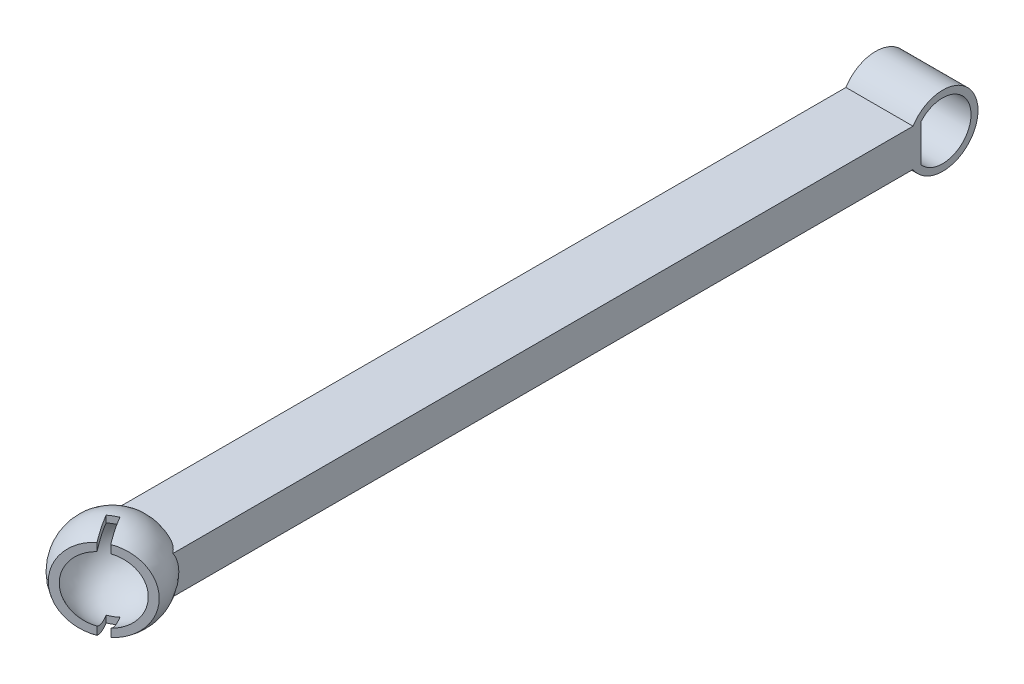
ISO-10303-21;
HEADER;
FILE_DESCRIPTION(('STEP AP214'),'2;1');
FILE_NAME('part.step','',(''),(''),'','','');
FILE_SCHEMA(('AUTOMOTIVE_DESIGN { 1 0 10303 214 1 1 1 1 }'));
ENDSEC;
DATA;
#1=APPLICATION_CONTEXT('core data for automotive mechanical design processes');
#2=APPLICATION_PROTOCOL_DEFINITION('international standard','automotive_design',2000,#1);
#3=PRODUCT_CONTEXT('',#1,'mechanical');
#4=PRODUCT('Part','Part','',(#3));
#5=PRODUCT_RELATED_PRODUCT_CATEGORY('part','',(#4));
#6=PRODUCT_DEFINITION_FORMATION('','',#4);
#7=PRODUCT_DEFINITION_CONTEXT('part definition',#1,'design');
#8=PRODUCT_DEFINITION('design','',#6,#7);
#9=PRODUCT_DEFINITION_SHAPE('','',#8);
#10=(LENGTH_UNIT() NAMED_UNIT(*) SI_UNIT(.MILLI.,.METRE.));
#11=(NAMED_UNIT(*) PLANE_ANGLE_UNIT() SI_UNIT($,.RADIAN.));
#12=(NAMED_UNIT(*) SI_UNIT($,.STERADIAN.) SOLID_ANGLE_UNIT());
#13=UNCERTAINTY_MEASURE_WITH_UNIT(LENGTH_MEASURE(1.E-05),#10,'distance_accuracy_value','');
#14=(GEOMETRIC_REPRESENTATION_CONTEXT(3) GLOBAL_UNCERTAINTY_ASSIGNED_CONTEXT((#13)) GLOBAL_UNIT_ASSIGNED_CONTEXT((#10,
#11,#12)) REPRESENTATION_CONTEXT('',''));
#15=CARTESIAN_POINT('',(0.,0.,0.));
#16=DIRECTION('',(0.,0.,1.));
#17=DIRECTION('',(1.,0.,0.));
#18=AXIS2_PLACEMENT_3D('',#15,#16,#17);
#19=CARTESIAN_POINT('',(-24.8547884615764,0.,113.899321100074));
#20=DIRECTION('',(0.499999999999998,0.,0.86602540378444));
#21=DIRECTION('',(0.86602540378444,0.,-0.499999999999998));
#22=AXIS2_PLACEMENT_3D('',#19,#20,#21);
#23=PLANE('',#22);
#24=DIRECTION('',(0.,-1.,0.));
#25=VECTOR('',#24,1.);
#26=CARTESIAN_POINT('',(-5.51062688470104,-23.9262644459295,102.730964206417));
#27=LINE('',#26,#25);
#28=CARTESIAN_POINT('',(-5.51062688470104,-13.5200077586692,102.730964206417));
#29=VERTEX_POINT('',#28);
#30=CARTESIAN_POINT('',(-5.51062688470103,-14.4817744480449,102.730964206417));
#31=VERTEX_POINT('',#30);
#32=EDGE_CURVE('E244',#29,#31,#27,.T.);
#33=ORIENTED_EDGE('',*,*,#32,.F.);
#34=CARTESIAN_POINT('',(-4.9996305065862,-18.3262644459295,102.435940309958));
#35=DIRECTION('',(0.499999999999998,0.,0.86602540378444));
#36=DIRECTION('',(0.86602540378444,0.,-0.499999999999998));
#37=AXIS2_PLACEMENT_3D('',#34,#35,#36);
#38=CIRCLE('',#37,4.84234031659929);
#39=CARTESIAN_POINT('',(-5.51062688470104,-23.1325211331898,102.730964206417));
#40=VERTEX_POINT('',#39);
#41=EDGE_CURVE('E165',#40,#29,#38,.F.);
#42=ORIENTED_EDGE('',*,*,#41,.F.);
#43=CARTESIAN_POINT('',(-5.51062688470103,-22.170754443814,102.730964206417));
#44=VERTEX_POINT('',#43);
#45=EDGE_CURVE('E157',#44,#40,#27,.T.);
#46=ORIENTED_EDGE('',*,*,#45,.F.);
#47=CARTESIAN_POINT('',(-4.9996305065862,-18.3262644459295,102.435940309958));
#48=DIRECTION('',(0.499999999999998,0.,0.86602540378444));
#49=DIRECTION('',(0.86602540378444,0.,-0.499999999999998));
#50=AXIS2_PLACEMENT_3D('',#47,#48,#49);
#51=CIRCLE('',#50,3.88950636222168);
#52=EDGE_CURVE('E166',#44,#31,#51,.F.);
#53=ORIENTED_EDGE('',*,*,#52,.T.);
#54=EDGE_LOOP('',(#33,#42,#46,#53));
#55=FACE_BOUND('',#54,.T.);
#56=ADVANCED_FACE('F37',(#55),#23,.T.);
#57=CARTESIAN_POINT('',(-6.40602130027024,-18.3262644459295,100.));
#58=DIRECTION('',(0.,1.,0.));
#59=DIRECTION('',(1.,0.,0.));
#60=AXIS2_PLACEMENT_3D('',#57,#58,#59);
#61=SPHERICAL_SURFACE('',#60,5.6);
#62=CARTESIAN_POINT('',(-6.9170176783851,-18.3262644459295,100.29502389646));
#63=DIRECTION('',(-0.86602540378444,0.,0.499999999999998));
#64=DIRECTION('',(0.499999999999998,0.,0.86602540378444));
#65=AXIS2_PLACEMENT_3D('',#62,#63,#64);
#66=CIRCLE('',#65,5.56882784812669);
#67=CARTESIAN_POINT('',(-7.01062688470102,-23.8919443566001,100.132887995064));
#68=VERTEX_POINT('',#67);
#69=EDGE_CURVE('E223',#40,#68,#66,.F.);
#70=ORIENTED_EDGE('',*,*,#69,.F.);
#71=ORIENTED_EDGE('',*,*,#41,.T.);
#72=CARTESIAN_POINT('',(-7.01062688470102,-12.7605845352588,100.132887995064));
#73=VERTEX_POINT('',#72);
#74=EDGE_CURVE('E146',#73,#29,#66,.F.);
#75=ORIENTED_EDGE('',*,*,#74,.F.);
#76=CARTESIAN_POINT('',(-6.49963050658617,-18.3262644459295,99.8378640986046));
#77=DIRECTION('',(0.499999999999994,0.,0.866025403784442));
#78=DIRECTION('',(0.866025403784442,0.,-0.499999999999994));
#79=AXIS2_PLACEMENT_3D('',#76,#77,#78);
#80=CIRCLE('',#79,5.59686959522657);
#81=CARTESIAN_POINT('',(-5.9713964001597,-12.7627307153722,99.5328879950642));
#82=VERTEX_POINT('',#81);
#83=EDGE_CURVE('E248',#73,#82,#80,.F.);
#84=ORIENTED_EDGE('',*,*,#83,.T.);
#85=CARTESIAN_POINT('',(-5.87778719384377,-18.3262644459295,99.6950238964595));
#86=DIRECTION('',(0.86602540378444,0.,-0.499999999999998));
#87=DIRECTION('',(-0.499999999999998,0.,-0.86602540378444));
#88=AXIS2_PLACEMENT_3D('',#85,#86,#87);
#89=CIRCLE('',#88,5.56668288166994);
#90=CARTESIAN_POINT('',(-4.47139640015971,-13.5224932141949,102.130964206417));
#91=VERTEX_POINT('',#90);
#92=EDGE_CURVE('E147',#91,#82,#89,.F.);
#93=ORIENTED_EDGE('',*,*,#92,.F.);
#94=CARTESIAN_POINT('',(-4.47139640015971,-23.130035677664,102.130964206417));
#95=VERTEX_POINT('',#94);
#96=EDGE_CURVE('E154',#91,#95,#38,.F.);
#97=ORIENTED_EDGE('',*,*,#96,.T.);
#98=CARTESIAN_POINT('',(-5.9713964001597,-23.8897981764867,99.5328879950642));
#99=VERTEX_POINT('',#98);
#100=EDGE_CURVE('E138',#99,#95,#89,.F.);
#101=ORIENTED_EDGE('',*,*,#100,.F.);
#102=EDGE_CURVE('E249',#99,#68,#80,.F.);
#103=ORIENTED_EDGE('',*,*,#102,.T.);
#104=EDGE_LOOP('',(#70,#71,#75,#84,#93,#97,#101,#103));
#105=FACE_BOUND('',#104,.T.);
#106=CARTESIAN_POINT('',(-10.4060213002702,-18.3262644459295,100.));
#107=DIRECTION('',(1.,0.,0.));
#108=DIRECTION('',(0.,1.,0.));
#109=AXIS2_PLACEMENT_3D('',#106,#107,#108);
#110=CIRCLE('',#109,3.91918358845309);
#111=CARTESIAN_POINT('',(-10.4060213002702,-20.5629394281161,96.7817263907399));
#112=VERTEX_POINT('',#111);
#113=CARTESIAN_POINT('',(-10.4060213002702,-16.0895894637428,96.7817263907399));
#114=VERTEX_POINT('',#113);
#115=EDGE_CURVE('E176',#112,#114,#110,.T.);
#116=ORIENTED_EDGE('',*,*,#115,.F.);
#117=CARTESIAN_POINT('',(-6.40602130027024,-20.5629394281161,100.));
#118=DIRECTION('',(0.,-1.,0.));
#119=DIRECTION('',(1.,0.,0.));
#120=AXIS2_PLACEMENT_3D('',#117,#118,#119);
#121=CIRCLE('',#120,5.13393465327134);
#122=CARTESIAN_POINT('',(-2.40602130027024,-20.5629394281161,96.7817263907399));
#123=VERTEX_POINT('',#122);
#124=EDGE_CURVE('E179',#112,#123,#121,.T.);
#125=ORIENTED_EDGE('',*,*,#124,.T.);
#126=CARTESIAN_POINT('',(-2.40602130027024,-18.3262644459295,100.));
#127=DIRECTION('',(-1.,0.,0.));
#128=DIRECTION('',(0.,-1.,0.));
#129=AXIS2_PLACEMENT_3D('',#126,#127,#128);
#130=CIRCLE('',#129,3.91918358845308);
#131=CARTESIAN_POINT('',(-2.40602130027024,-16.0895894637428,96.7817263907399));
#132=VERTEX_POINT('',#131);
#133=EDGE_CURVE('E169',#132,#123,#130,.T.);
#134=ORIENTED_EDGE('',*,*,#133,.F.);
#135=CARTESIAN_POINT('',(-6.40602130027024,-16.0895894637428,100.));
#136=DIRECTION('',(0.,-1.,0.));
#137=DIRECTION('',(1.,0.,0.));
#138=AXIS2_PLACEMENT_3D('',#135,#136,#137);
#139=CIRCLE('',#138,5.13393465327134);
#140=EDGE_CURVE('E219',#114,#132,#139,.T.);
#141=ORIENTED_EDGE('',*,*,#140,.F.);
#142=EDGE_LOOP('',(#116,#125,#134,#141));
#143=FACE_BOUND('',#142,.T.);
#144=ADVANCED_FACE('F162',(#105,#143),#61,.T.);
#145=CARTESIAN_POINT('',(-10.4060213002702,-12.3317262756318,100.));
#146=DIRECTION('',(1.,0.,0.));
#147=DIRECTION('',(0.,1.,0.));
#148=AXIS2_PLACEMENT_3D('',#145,#146,#147);
#149=PLANE('',#148);
#150=DIRECTION('',(0.,-1.,0.));
#151=VECTOR('',#150,1.);
#152=CARTESIAN_POINT('',(-10.4060213002702,0.,7.55593867625419));
#153=LINE('',#152,#151);
#154=CARTESIAN_POINT('',(-10.4060213002702,-16.0895894637428,7.55593867625418));
#155=VERTEX_POINT('',#154);
#156=CARTESIAN_POINT('',(-10.4060213002702,-20.5738630875209,7.55593867625418));
#157=VERTEX_POINT('',#156);
#158=EDGE_CURVE('E200',#155,#157,#153,.T.);
#159=ORIENTED_EDGE('',*,*,#158,.T.);
#160=CARTESIAN_POINT('',(-10.4060213002702,-18.3317262756318,5.));
#161=DIRECTION('',(-1.,0.,0.));
#162=DIRECTION('',(0.,-1.,0.));
#163=AXIS2_PLACEMENT_3D('',#160,#161,#162);
#164=CIRCLE('',#163,3.4);
#165=EDGE_CURVE('E203',#155,#157,#164,.T.);
#166=ORIENTED_EDGE('',*,*,#165,.F.);
#167=EDGE_LOOP('',(#159,#166));
#168=FACE_BOUND('',#167,.T.);
#169=DIRECTION('',(0.,0.,1.));
#170=VECTOR('',#169,1.);
#171=CARTESIAN_POINT('',(-10.4060213002702,-20.5629394281161,0.));
#172=LINE('',#171,#170);
#173=CARTESIAN_POINT('',(-10.4060213002702,-20.5629394281161,8.52899757981099));
#174=VERTEX_POINT('',#173);
#175=EDGE_CURVE('E187',#174,#112,#172,.T.);
#176=ORIENTED_EDGE('',*,*,#175,.T.);
#177=ORIENTED_EDGE('',*,*,#115,.T.);
#178=DIRECTION('',(0.,0.,1.));
#179=VECTOR('',#178,1.);
#180=CARTESIAN_POINT('',(-10.4060213002702,-16.0895894637428,0.));
#181=LINE('',#180,#179);
#182=CARTESIAN_POINT('',(-10.4060213002702,-16.0895894637428,8.52212460336182));
#183=VERTEX_POINT('',#182);
#184=EDGE_CURVE('E184',#183,#114,#181,.T.);
#185=ORIENTED_EDGE('',*,*,#184,.F.);
#186=CARTESIAN_POINT('',(-10.4060213002702,-18.3317262756319,4.97067102535014));
#187=DIRECTION('',(-1.,0.,0.));
#188=DIRECTION('',(0.,-1.,0.));
#189=AXIS2_PLACEMENT_3D('',#186,#187,#188);
#190=CIRCLE('',#189,4.2);
#191=EDGE_CURVE('E181',#183,#174,#190,.T.);
#192=ORIENTED_EDGE('',*,*,#191,.T.);
#193=EDGE_LOOP('',(#176,#177,#185,#192));
#194=FACE_BOUND('',#193,.T.);
#195=ADVANCED_FACE('F39',(#168,#194),#149,.F.);
#196=CARTESIAN_POINT('',(-2.40602130027024,-12.3317262756318,100.));
#197=DIRECTION('',(-1.,0.,0.));
#198=DIRECTION('',(0.,-1.,0.));
#199=AXIS2_PLACEMENT_3D('',#196,#197,#198);
#200=PLANE('',#199);
#201=DIRECTION('',(0.,-1.,0.));
#202=VECTOR('',#201,1.);
#203=CARTESIAN_POINT('',(-2.40602130027024,-12.3317262756318,7.55593867625419));
#204=LINE('',#203,#202);
#205=CARTESIAN_POINT('',(-2.40602130027024,-16.0895894637428,7.55593867625418));
#206=VERTEX_POINT('',#205);
#207=CARTESIAN_POINT('',(-2.40602130027024,-20.5738630875209,7.55593867625418));
#208=VERTEX_POINT('',#207);
#209=EDGE_CURVE('E214',#206,#208,#204,.T.);
#210=ORIENTED_EDGE('',*,*,#209,.F.);
#211=CARTESIAN_POINT('',(-2.40602130027024,-18.3317262756318,5.));
#212=DIRECTION('',(-1.,0.,0.));
#213=DIRECTION('',(0.,-1.,0.));
#214=AXIS2_PLACEMENT_3D('',#211,#212,#213);
#215=CIRCLE('',#214,3.4);
#216=EDGE_CURVE('E209',#206,#208,#215,.T.);
#217=ORIENTED_EDGE('',*,*,#216,.T.);
#218=EDGE_LOOP('',(#210,#217));
#219=FACE_BOUND('',#218,.T.);
#220=DIRECTION('',(0.,0.,1.));
#221=VECTOR('',#220,1.);
#222=CARTESIAN_POINT('',(-2.40602130027024,-16.0895894637428,100.));
#223=LINE('',#222,#221);
#224=CARTESIAN_POINT('',(-2.40602130027025,-16.0895894637428,8.52212460336182));
#225=VERTEX_POINT('',#224);
#226=EDGE_CURVE('E193',#225,#132,#223,.T.);
#227=ORIENTED_EDGE('',*,*,#226,.T.);
#228=ORIENTED_EDGE('',*,*,#133,.T.);
#229=DIRECTION('',(0.,0.,1.));
#230=VECTOR('',#229,1.);
#231=CARTESIAN_POINT('',(-2.40602130027024,-20.5629394281161,100.));
#232=LINE('',#231,#230);
#233=CARTESIAN_POINT('',(-2.40602130027025,-20.5629394281161,8.52899757981099));
#234=VERTEX_POINT('',#233);
#235=EDGE_CURVE('E197',#234,#123,#232,.T.);
#236=ORIENTED_EDGE('',*,*,#235,.F.);
#237=CARTESIAN_POINT('',(-2.40602130027025,-18.3317262756319,4.97067102535014));
#238=DIRECTION('',(-1.,0.,0.));
#239=DIRECTION('',(0.,-1.,0.));
#240=AXIS2_PLACEMENT_3D('',#237,#238,#239);
#241=CIRCLE('',#240,4.2);
#242=EDGE_CURVE('E217',#225,#234,#241,.T.);
#243=ORIENTED_EDGE('',*,*,#242,.F.);
#244=EDGE_LOOP('',(#227,#228,#236,#243));
#245=FACE_BOUND('',#244,.T.);
#246=ADVANCED_FACE('F300',(#219,#245),#200,.F.);
#247=CARTESIAN_POINT('',(-0.406021300270244,0.,7.55593867625419));
#248=DIRECTION('',(0.,0.,-1.));
#249=DIRECTION('',(0.,1.,0.));
#250=AXIS2_PLACEMENT_3D('',#247,#248,#249);
#251=PLANE('',#250);
#252=ORIENTED_EDGE('',*,*,#209,.T.);
#253=DIRECTION('',(-1.,0.,0.));
#254=VECTOR('',#253,1.);
#255=CARTESIAN_POINT('',(-0.40602130027024,-20.5738630875209,7.55593867625418));
#256=LINE('',#255,#254);
#257=EDGE_CURVE('E207',#208,#157,#256,.T.);
#258=ORIENTED_EDGE('',*,*,#257,.T.);
#259=ORIENTED_EDGE('',*,*,#158,.F.);
#260=DIRECTION('',(-1.,0.,0.));
#261=VECTOR('',#260,1.);
#262=CARTESIAN_POINT('',(-0.406021300270242,-16.0895894637428,7.55593867625418));
#263=LINE('',#262,#261);
#264=EDGE_CURVE('E206',#206,#155,#263,.T.);
#265=ORIENTED_EDGE('',*,*,#264,.F.);
#266=EDGE_LOOP('',(#252,#258,#259,#265));
#267=FACE_BOUND('',#266,.T.);
#268=ADVANCED_FACE('F297',(#267),#251,.T.);
#269=CARTESIAN_POINT('',(-0.40602130027024,-18.3317262756318,5.));
#270=DIRECTION('',(-1.,0.,0.));
#271=DIRECTION('',(0.,-1.,0.));
#272=AXIS2_PLACEMENT_3D('',#269,#270,#271);
#273=CYLINDRICAL_SURFACE('',#272,3.4);
#274=ORIENTED_EDGE('',*,*,#264,.T.);
#275=ORIENTED_EDGE('',*,*,#165,.T.);
#276=ORIENTED_EDGE('',*,*,#257,.F.);
#277=ORIENTED_EDGE('',*,*,#216,.F.);
#278=EDGE_LOOP('',(#274,#275,#276,#277));
#279=FACE_BOUND('',#278,.T.);
#280=ADVANCED_FACE('F293',(#279),#273,.F.);
#281=CARTESIAN_POINT('',(89.5939786997298,-18.3317262756318,4.97067102535014));
#282=DIRECTION('',(-1.,0.,0.));
#283=DIRECTION('',(0.,-1.,0.));
#284=AXIS2_PLACEMENT_3D('',#281,#282,#283);
#285=CYLINDRICAL_SURFACE('',#284,4.2);
#286=ORIENTED_EDGE('',*,*,#242,.T.);
#287=DIRECTION('',(-1.,0.,0.));
#288=VECTOR('',#287,1.);
#289=CARTESIAN_POINT('',(89.5939786997298,-20.5629394281161,8.52899757981099));
#290=LINE('',#289,#288);
#291=EDGE_CURVE('E191',#234,#174,#290,.T.);
#292=ORIENTED_EDGE('',*,*,#291,.T.);
#293=ORIENTED_EDGE('',*,*,#191,.F.);
#294=DIRECTION('',(-1.,0.,0.));
#295=VECTOR('',#294,1.);
#296=CARTESIAN_POINT('',(89.5939786997298,-16.0895894637428,8.52212460336182));
#297=LINE('',#296,#295);
#298=EDGE_CURVE('E190',#225,#183,#297,.T.);
#299=ORIENTED_EDGE('',*,*,#298,.F.);
#300=EDGE_LOOP('',(#286,#292,#293,#299));
#301=FACE_BOUND('',#300,.T.);
#302=ADVANCED_FACE('F287',(#301),#285,.T.);
#303=CARTESIAN_POINT('',(89.5939786997298,-20.5629394281161,0.));
#304=DIRECTION('',(0.,-1.,0.));
#305=DIRECTION('',(1.,0.,0.));
#306=AXIS2_PLACEMENT_3D('',#303,#304,#305);
#307=PLANE('',#306);
#308=ORIENTED_EDGE('',*,*,#124,.F.);
#309=ORIENTED_EDGE('',*,*,#175,.F.);
#310=ORIENTED_EDGE('',*,*,#291,.F.);
#311=ORIENTED_EDGE('',*,*,#235,.T.);
#312=EDGE_LOOP('',(#308,#309,#310,#311));
#313=FACE_BOUND('',#312,.T.);
#314=ADVANCED_FACE('F281',(#313),#307,.T.);
#315=CARTESIAN_POINT('',(89.5939786997298,-16.0895894637428,0.));
#316=DIRECTION('',(0.,-1.,0.));
#317=DIRECTION('',(1.,0.,0.));
#318=AXIS2_PLACEMENT_3D('',#315,#316,#317);
#319=PLANE('',#318);
#320=ORIENTED_EDGE('',*,*,#184,.T.);
#321=ORIENTED_EDGE('',*,*,#140,.T.);
#322=ORIENTED_EDGE('',*,*,#226,.F.);
#323=ORIENTED_EDGE('',*,*,#298,.T.);
#324=EDGE_LOOP('',(#320,#321,#322,#323));
#325=FACE_BOUND('',#324,.T.);
#326=ADVANCED_FACE('F276',(#325),#319,.F.);
#327=DIRECTION('',(0.,1.,0.));
#328=VECTOR('',#327,1.);
#329=CARTESIAN_POINT('',(-4.47139640015971,-23.9262644459295,102.130964206417));
#330=LINE('',#329,#328);
#331=CARTESIAN_POINT('',(-4.47139640015971,-22.1676467553123,102.130964206417));
#332=VERTEX_POINT('',#331);
#333=EDGE_CURVE('E141',#95,#332,#330,.T.);
#334=ORIENTED_EDGE('',*,*,#333,.F.);
#335=ORIENTED_EDGE('',*,*,#96,.F.);
#336=CARTESIAN_POINT('',(-4.47139640015971,-14.4848821365466,102.130964206417));
#337=VERTEX_POINT('',#336);
#338=EDGE_CURVE('E158',#337,#91,#330,.T.);
#339=ORIENTED_EDGE('',*,*,#338,.F.);
#340=EDGE_CURVE('E156',#337,#332,#51,.F.);
#341=ORIENTED_EDGE('',*,*,#340,.T.);
#342=EDGE_LOOP('',(#334,#335,#339,#341));
#343=FACE_BOUND('',#342,.T.);
#344=ADVANCED_FACE('F152',(#343),#23,.T.);
#345=CARTESIAN_POINT('',(-6.40602130027024,-18.3262644459295,100.));
#346=DIRECTION('',(0.,1.,0.));
#347=DIRECTION('',(1.,0.,0.));
#348=AXIS2_PLACEMENT_3D('',#345,#346,#347);
#349=SPHERICAL_SURFACE('',#348,4.8);
#350=ORIENTED_EDGE('',*,*,#52,.F.);
#351=CARTESIAN_POINT('',(-6.9170176783851,-18.3262644459295,100.29502389646));
#352=DIRECTION('',(-0.86602540378444,0.,0.499999999999998));
#353=DIRECTION('',(0.499999999999998,0.,0.86602540378444));
#354=AXIS2_PLACEMENT_3D('',#351,#352,#353);
#355=CIRCLE('',#354,4.76359565896092);
#356=CARTESIAN_POINT('',(-7.01062688470102,-23.0861796624058,100.132887995064));
#357=VERTEX_POINT('',#356);
#358=EDGE_CURVE('E11',#44,#357,#355,.F.);
#359=ORIENTED_EDGE('',*,*,#358,.T.);
#360=CARTESIAN_POINT('',(-6.49963050658617,-18.3262644459295,99.8378640986046));
#361=DIRECTION('',(0.499999999999994,0.,0.866025403784442));
#362=DIRECTION('',(0.866025403784442,0.,-0.499999999999994));
#363=AXIS2_PLACEMENT_3D('',#360,#361,#362);
#364=CIRCLE('',#363,4.796347492204);
#365=CARTESIAN_POINT('',(-5.9713964001597,-23.083669996337,99.5328879950642));
#366=VERTEX_POINT('',#365);
#367=EDGE_CURVE('E225',#366,#357,#364,.F.);
#368=ORIENTED_EDGE('',*,*,#367,.F.);
#369=CARTESIAN_POINT('',(-5.87778719384377,-18.3262644459295,99.6950238964595));
#370=DIRECTION('',(0.86602540378444,0.,-0.499999999999998));
#371=DIRECTION('',(-0.499999999999998,0.,-0.86602540378444));
#372=AXIS2_PLACEMENT_3D('',#369,#370,#371);
#373=CIRCLE('',#372,4.76108793292847);
#374=EDGE_CURVE('E46',#366,#332,#373,.F.);
#375=ORIENTED_EDGE('',*,*,#374,.T.);
#376=ORIENTED_EDGE('',*,*,#340,.F.);
#377=CARTESIAN_POINT('',(-5.9713964001597,-13.5688588955219,99.5328879950642));
#378=VERTEX_POINT('',#377);
#379=EDGE_CURVE('E224',#337,#378,#373,.F.);
#380=ORIENTED_EDGE('',*,*,#379,.T.);
#381=CARTESIAN_POINT('',(-7.01062688470102,-13.5663492294531,100.132887995064));
#382=VERTEX_POINT('',#381);
#383=EDGE_CURVE('E221',#382,#378,#364,.F.);
#384=ORIENTED_EDGE('',*,*,#383,.F.);
#385=EDGE_CURVE('E41',#382,#31,#355,.F.);
#386=ORIENTED_EDGE('',*,*,#385,.T.);
#387=EDGE_LOOP('',(#350,#359,#368,#375,#376,#380,#384,#386));
#388=FACE_BOUND('',#387,.T.);
#389=ADVANCED_FACE('F240',(#388),#349,.F.);
#390=CARTESIAN_POINT('',(41.6061556578381,0.,72.0639755069962));
#391=DIRECTION('',(0.499999999999994,0.,0.866025403784442));
#392=DIRECTION('',(0.866025403784442,0.,-0.499999999999994));
#393=AXIS2_PLACEMENT_3D('',#390,#391,#392);
#394=PLANE('',#393);
#395=DIRECTION('',(0.,-1.,0.));
#396=VECTOR('',#395,1.);
#397=CARTESIAN_POINT('',(-7.01062688470104,-23.9262644459295,100.132887995064));
#398=LINE('',#397,#396);
#399=EDGE_CURVE('E61',#73,#382,#398,.T.);
#400=ORIENTED_EDGE('',*,*,#399,.T.);
#401=ORIENTED_EDGE('',*,*,#383,.T.);
#402=DIRECTION('',(0.,1.,0.));
#403=VECTOR('',#402,1.);
#404=CARTESIAN_POINT('',(-5.97139640015971,-23.9262644459295,99.5328879950641));
#405=LINE('',#404,#403);
#406=EDGE_CURVE('E246',#378,#82,#405,.T.);
#407=ORIENTED_EDGE('',*,*,#406,.T.);
#408=ORIENTED_EDGE('',*,*,#83,.F.);
#409=EDGE_LOOP('',(#400,#401,#407,#408));
#410=FACE_BOUND('',#409,.T.);
#411=ADVANCED_FACE('F256',(#410),#394,.T.);
#412=CARTESIAN_POINT('',(-5.97139640015971,-23.9262644459295,99.5328879950641));
#413=DIRECTION('',(0.86602540378444,0.,-0.499999999999998));
#414=DIRECTION('',(-0.499999999999998,0.,-0.86602540378444));
#415=AXIS2_PLACEMENT_3D('',#412,#413,#414);
#416=PLANE('',#415);
#417=ORIENTED_EDGE('',*,*,#92,.T.);
#418=ORIENTED_EDGE('',*,*,#406,.F.);
#419=ORIENTED_EDGE('',*,*,#379,.F.);
#420=ORIENTED_EDGE('',*,*,#338,.T.);
#421=EDGE_LOOP('',(#417,#418,#419,#420));
#422=FACE_BOUND('',#421,.T.);
#423=ADVANCED_FACE('F258',(#422),#416,.F.);
#424=CARTESIAN_POINT('',(-7.01062688470104,-23.9262644459295,100.132887995064));
#425=DIRECTION('',(-0.86602540378444,0.,0.499999999999998));
#426=DIRECTION('',(0.499999999999998,0.,0.86602540378444));
#427=AXIS2_PLACEMENT_3D('',#424,#425,#426);
#428=PLANE('',#427);
#429=ORIENTED_EDGE('',*,*,#74,.T.);
#430=ORIENTED_EDGE('',*,*,#32,.T.);
#431=ORIENTED_EDGE('',*,*,#385,.F.);
#432=ORIENTED_EDGE('',*,*,#399,.F.);
#433=EDGE_LOOP('',(#429,#430,#431,#432));
#434=FACE_BOUND('',#433,.T.);
#435=ADVANCED_FACE('F255',(#434),#428,.F.);
#436=ORIENTED_EDGE('',*,*,#69,.T.);
#437=EDGE_CURVE('E234',#357,#68,#398,.T.);
#438=ORIENTED_EDGE('',*,*,#437,.F.);
#439=ORIENTED_EDGE('',*,*,#358,.F.);
#440=ORIENTED_EDGE('',*,*,#45,.T.);
#441=EDGE_LOOP('',(#436,#438,#439,#440));
#442=FACE_BOUND('',#441,.T.);
#443=ADVANCED_FACE('F236',(#442),#428,.F.);
#444=ORIENTED_EDGE('',*,*,#100,.T.);
#445=ORIENTED_EDGE('',*,*,#333,.T.);
#446=ORIENTED_EDGE('',*,*,#374,.F.);
#447=EDGE_CURVE('E53',#99,#366,#405,.T.);
#448=ORIENTED_EDGE('',*,*,#447,.F.);
#449=EDGE_LOOP('',(#444,#445,#446,#448));
#450=FACE_BOUND('',#449,.T.);
#451=ADVANCED_FACE('F140',(#450),#416,.F.);
#452=ORIENTED_EDGE('',*,*,#447,.T.);
#453=ORIENTED_EDGE('',*,*,#367,.T.);
#454=ORIENTED_EDGE('',*,*,#437,.T.);
#455=ORIENTED_EDGE('',*,*,#102,.F.);
#456=EDGE_LOOP('',(#452,#453,#454,#455));
#457=FACE_BOUND('',#456,.T.);
#458=ADVANCED_FACE('F233',(#457),#394,.T.);
#459=CLOSED_SHELL('',(#56,#144,#195,#246,#268,#280,#302,#314,#326,#344,#389,#411,#423,#435,#443,
#451,#458));
#460=MANIFOLD_SOLID_BREP('B2',#459);
#461=ADVANCED_BREP_SHAPE_REPRESENTATION('',(#18,#460),#14);
#462=SHAPE_DEFINITION_REPRESENTATION(#9,#461);
ENDSEC;
END-ISO-10303-21;
